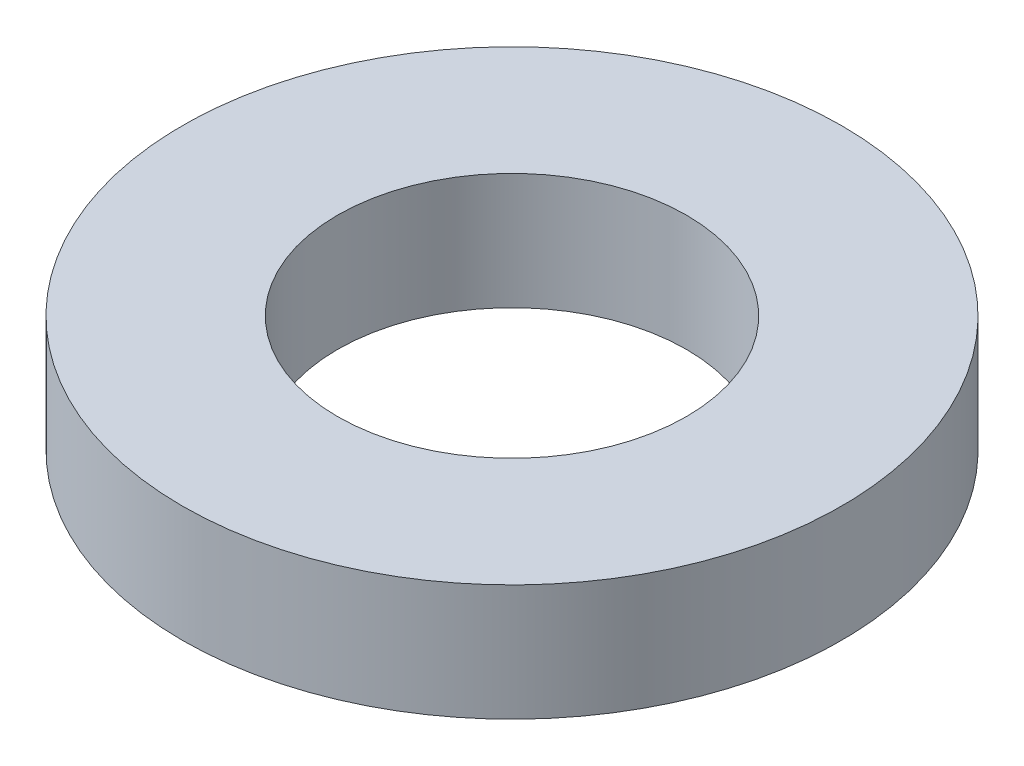
ISO-10303-21;
HEADER;
FILE_DESCRIPTION(('STEP AP214'),'2;1');
FILE_NAME('part.step','',(''),(''),'','','');
FILE_SCHEMA(('AUTOMOTIVE_DESIGN { 1 0 10303 214 1 1 1 1 }'));
ENDSEC;
DATA;
#1=APPLICATION_CONTEXT('core data for automotive mechanical design processes');
#2=APPLICATION_PROTOCOL_DEFINITION('international standard','automotive_design',2000,#1);
#3=PRODUCT_CONTEXT('',#1,'mechanical');
#4=PRODUCT('Part','Part','',(#3));
#5=PRODUCT_RELATED_PRODUCT_CATEGORY('part','',(#4));
#6=PRODUCT_DEFINITION_FORMATION('','',#4);
#7=PRODUCT_DEFINITION_CONTEXT('part definition',#1,'design');
#8=PRODUCT_DEFINITION('design','',#6,#7);
#9=PRODUCT_DEFINITION_SHAPE('','',#8);
#10=(LENGTH_UNIT() NAMED_UNIT(*) SI_UNIT(.MILLI.,.METRE.));
#11=(NAMED_UNIT(*) PLANE_ANGLE_UNIT() SI_UNIT($,.RADIAN.));
#12=(NAMED_UNIT(*) SI_UNIT($,.STERADIAN.) SOLID_ANGLE_UNIT());
#13=UNCERTAINTY_MEASURE_WITH_UNIT(LENGTH_MEASURE(1.E-05),#10,'distance_accuracy_value','');
#14=(GEOMETRIC_REPRESENTATION_CONTEXT(3) GLOBAL_UNCERTAINTY_ASSIGNED_CONTEXT((#13)) GLOBAL_UNIT_ASSIGNED_CONTEXT((#10,
#11,#12)) REPRESENTATION_CONTEXT('',''));
#15=CARTESIAN_POINT('',(0.,0.,0.));
#16=DIRECTION('',(0.,0.,1.));
#17=DIRECTION('',(1.,0.,0.));
#18=AXIS2_PLACEMENT_3D('',#15,#16,#17);
#19=CARTESIAN_POINT('',(0.,30.,0.));
#20=DIRECTION('',(0.,-1.,0.));
#21=DIRECTION('',(0.,0.,-1.));
#22=AXIS2_PLACEMENT_3D('',#19,#20,#21);
#23=CYLINDRICAL_SURFACE('',#22,85.);
#24=CARTESIAN_POINT('',(0.,30.,0.));
#25=DIRECTION('',(0.,1.,0.));
#26=DIRECTION('',(0.,0.,1.));
#27=AXIS2_PLACEMENT_3D('',#24,#25,#26);
#28=CIRCLE('',#27,85.);
#29=CARTESIAN_POINT('',(0.,30.,85.));
#30=VERTEX_POINT('',#29);
#31=EDGE_CURVE('E10',#30,#30,#28,.T.);
#32=ORIENTED_EDGE('',*,*,#31,.F.);
#33=EDGE_LOOP('',(#32));
#34=FACE_BOUND('',#33,.T.);
#35=CARTESIAN_POINT('',(0.,0.,0.));
#36=DIRECTION('',(0.,1.,0.));
#37=DIRECTION('',(0.,0.,1.));
#38=AXIS2_PLACEMENT_3D('',#35,#36,#37);
#39=CIRCLE('',#38,85.);
#40=CARTESIAN_POINT('',(0.,0.,85.));
#41=VERTEX_POINT('',#40);
#42=EDGE_CURVE('E37',#41,#41,#39,.T.);
#43=ORIENTED_EDGE('',*,*,#42,.T.);
#44=EDGE_LOOP('',(#43));
#45=FACE_BOUND('',#44,.T.);
#46=ADVANCED_FACE('F40',(#34,#45),#23,.T.);
#47=CARTESIAN_POINT('',(0.,30.,0.));
#48=DIRECTION('',(0.,1.,0.));
#49=DIRECTION('',(0.,0.,1.));
#50=AXIS2_PLACEMENT_3D('',#47,#48,#49);
#51=PLANE('',#50);
#52=CARTESIAN_POINT('',(0.,30.,0.));
#53=DIRECTION('',(0.,1.,0.));
#54=DIRECTION('',(0.,0.,1.));
#55=AXIS2_PLACEMENT_3D('',#52,#53,#54);
#56=CIRCLE('',#55,45.);
#57=CARTESIAN_POINT('',(0.,30.,45.));
#58=VERTEX_POINT('',#57);
#59=EDGE_CURVE('E50',#58,#58,#56,.T.);
#60=ORIENTED_EDGE('',*,*,#59,.F.);
#61=EDGE_LOOP('',(#60));
#62=FACE_BOUND('',#61,.T.);
#63=ORIENTED_EDGE('',*,*,#31,.T.);
#64=EDGE_LOOP('',(#63));
#65=FACE_BOUND('',#64,.T.);
#66=ADVANCED_FACE('F59',(#62,#65),#51,.T.);
#67=CARTESIAN_POINT('',(0.,0.,0.));
#68=DIRECTION('',(0.,1.,0.));
#69=DIRECTION('',(0.,0.,1.));
#70=AXIS2_PLACEMENT_3D('',#67,#68,#69);
#71=PLANE('',#70);
#72=CARTESIAN_POINT('',(0.,0.,0.));
#73=DIRECTION('',(0.,1.,0.));
#74=DIRECTION('',(0.,0.,1.));
#75=AXIS2_PLACEMENT_3D('',#72,#73,#74);
#76=CIRCLE('',#75,45.);
#77=CARTESIAN_POINT('',(0.,0.,45.));
#78=VERTEX_POINT('',#77);
#79=EDGE_CURVE('E47',#78,#78,#76,.T.);
#80=ORIENTED_EDGE('',*,*,#79,.T.);
#81=EDGE_LOOP('',(#80));
#82=FACE_BOUND('',#81,.T.);
#83=ORIENTED_EDGE('',*,*,#42,.F.);
#84=EDGE_LOOP('',(#83));
#85=FACE_BOUND('',#84,.T.);
#86=ADVANCED_FACE('F58',(#82,#85),#71,.F.);
#87=CARTESIAN_POINT('',(0.,30.,0.));
#88=DIRECTION('',(0.,-1.,0.));
#89=DIRECTION('',(0.,0.,-1.));
#90=AXIS2_PLACEMENT_3D('',#87,#88,#89);
#91=CYLINDRICAL_SURFACE('',#90,45.);
#92=ORIENTED_EDGE('',*,*,#59,.T.);
#93=EDGE_LOOP('',(#92));
#94=FACE_BOUND('',#93,.T.);
#95=ORIENTED_EDGE('',*,*,#79,.F.);
#96=EDGE_LOOP('',(#95));
#97=FACE_BOUND('',#96,.T.);
#98=ADVANCED_FACE('F54',(#94,#97),#91,.F.);
#99=CLOSED_SHELL('',(#46,#66,#86,#98));
#100=MANIFOLD_SOLID_BREP('B2',#99);
#101=ADVANCED_BREP_SHAPE_REPRESENTATION('',(#18,#100),#14);
#102=SHAPE_DEFINITION_REPRESENTATION(#9,#101);
ENDSEC;
END-ISO-10303-21;
